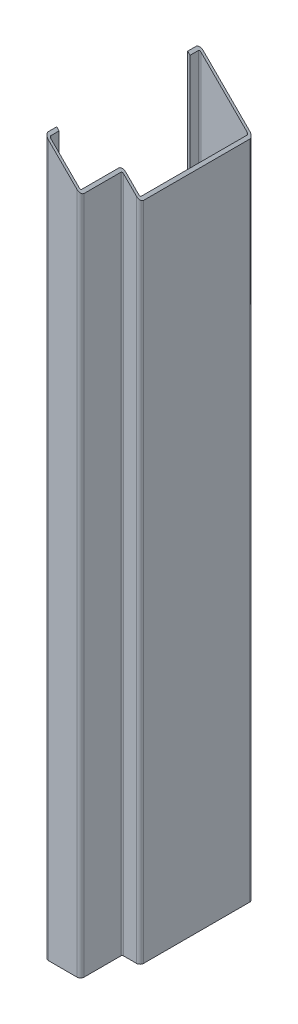
ISO-10303-21;
HEADER;
FILE_DESCRIPTION(('STEP AP214'),'2;1');
FILE_NAME('part.step','',(''),(''),'','','');
FILE_SCHEMA(('AUTOMOTIVE_DESIGN { 1 0 10303 214 1 1 1 1 }'));
ENDSEC;
DATA;
#1=APPLICATION_CONTEXT('core data for automotive mechanical design processes');
#2=APPLICATION_PROTOCOL_DEFINITION('international standard','automotive_design',2000,#1);
#3=PRODUCT_CONTEXT('',#1,'mechanical');
#4=PRODUCT('Part','Part','',(#3));
#5=PRODUCT_RELATED_PRODUCT_CATEGORY('part','',(#4));
#6=PRODUCT_DEFINITION_FORMATION('','',#4);
#7=PRODUCT_DEFINITION_CONTEXT('part definition',#1,'design');
#8=PRODUCT_DEFINITION('design','',#6,#7);
#9=PRODUCT_DEFINITION_SHAPE('','',#8);
#10=(LENGTH_UNIT() NAMED_UNIT(*) SI_UNIT(.MILLI.,.METRE.));
#11=(NAMED_UNIT(*) PLANE_ANGLE_UNIT() SI_UNIT($,.RADIAN.));
#12=(NAMED_UNIT(*) SI_UNIT($,.STERADIAN.) SOLID_ANGLE_UNIT());
#13=UNCERTAINTY_MEASURE_WITH_UNIT(LENGTH_MEASURE(1.E-05),#10,'distance_accuracy_value','');
#14=(GEOMETRIC_REPRESENTATION_CONTEXT(3) GLOBAL_UNCERTAINTY_ASSIGNED_CONTEXT((#13)) GLOBAL_UNIT_ASSIGNED_CONTEXT((#10,
#11,#12)) REPRESENTATION_CONTEXT('',''));
#15=CARTESIAN_POINT('',(0.,0.,0.));
#16=DIRECTION('',(0.,0.,1.));
#17=DIRECTION('',(1.,0.,0.));
#18=AXIS2_PLACEMENT_3D('',#15,#16,#17);
#19=CARTESIAN_POINT('',(-22.5,600.,-62.));
#20=DIRECTION('',(1.,0.,0.));
#21=DIRECTION('',(0.,0.,-1.));
#22=AXIS2_PLACEMENT_3D('',#19,#20,#21);
#23=PLANE('',#22);
#24=DIRECTION('',(0.,0.,1.));
#25=VECTOR('',#24,1.);
#26=CARTESIAN_POINT('',(-22.5,0.,-62.));
#27=LINE('',#26,#25);
#28=CARTESIAN_POINT('',(-22.5,0.,-62.));
#29=VERTEX_POINT('',#28);
#30=CARTESIAN_POINT('',(-22.5,0.,-55.));
#31=VERTEX_POINT('',#30);
#32=EDGE_CURVE('E166',#29,#31,#27,.T.);
#33=ORIENTED_EDGE('',*,*,#32,.T.);
#34=DIRECTION('',(0.,-1.,0.));
#35=VECTOR('',#34,1.);
#36=CARTESIAN_POINT('',(-22.5,600.,-55.));
#37=LINE('',#36,#35);
#38=CARTESIAN_POINT('',(-22.5,600.,-55.));
#39=VERTEX_POINT('',#38);
#40=EDGE_CURVE('E11',#39,#31,#37,.T.);
#41=ORIENTED_EDGE('',*,*,#40,.F.);
#42=DIRECTION('',(0.,0.,1.));
#43=VECTOR('',#42,1.);
#44=CARTESIAN_POINT('',(-22.5,600.,-62.));
#45=LINE('',#44,#43);
#46=CARTESIAN_POINT('',(-22.5,600.,-62.));
#47=VERTEX_POINT('',#46);
#48=EDGE_CURVE('E167',#47,#39,#45,.T.);
#49=ORIENTED_EDGE('',*,*,#48,.F.);
#50=DIRECTION('',(0.,-1.,0.));
#51=VECTOR('',#50,1.);
#52=CARTESIAN_POINT('',(-22.5,600.,-62.));
#53=LINE('',#52,#51);
#54=EDGE_CURVE('E151',#47,#29,#53,.T.);
#55=ORIENTED_EDGE('',*,*,#54,.T.);
#56=EDGE_LOOP('',(#33,#41,#49,#55));
#57=FACE_BOUND('',#56,.T.);
#58=ADVANCED_FACE('F35',(#57),#23,.F.);
#59=CARTESIAN_POINT('',(-20.5,600.,-55.));
#60=DIRECTION('',(0.,0.,1.));
#61=DIRECTION('',(1.,0.,0.));
#62=AXIS2_PLACEMENT_3D('',#59,#60,#61);
#63=PLANE('',#62);
#64=DIRECTION('',(0.707106781186547,-0.707106781186548,0.));
#65=VECTOR('',#64,1.);
#66=CARTESIAN_POINT('',(-21.5,599.,-55.));
#67=LINE('',#66,#65);
#68=CARTESIAN_POINT('',(-20.5,598.,-55.));
#69=VERTEX_POINT('',#68);
#70=EDGE_CURVE('E426',#39,#69,#67,.T.);
#71=ORIENTED_EDGE('',*,*,#70,.F.);
#72=ORIENTED_EDGE('',*,*,#40,.T.);
#73=DIRECTION('',(-1.,0.,0.));
#74=VECTOR('',#73,1.);
#75=CARTESIAN_POINT('',(-20.5,0.,-55.));
#76=LINE('',#75,#74);
#77=CARTESIAN_POINT('',(-20.5,0.,-55.));
#78=VERTEX_POINT('',#77);
#79=EDGE_CURVE('E236',#78,#31,#76,.T.);
#80=ORIENTED_EDGE('',*,*,#79,.F.);
#81=DIRECTION('',(0.,-1.,0.));
#82=VECTOR('',#81,1.);
#83=CARTESIAN_POINT('',(-20.5,600.,-55.));
#84=LINE('',#83,#82);
#85=EDGE_CURVE('E43',#69,#78,#84,.T.);
#86=ORIENTED_EDGE('',*,*,#85,.F.);
#87=EDGE_LOOP('',(#71,#72,#80,#86));
#88=FACE_BOUND('',#87,.T.);
#89=ADVANCED_FACE('F237',(#88),#63,.T.);
#90=CARTESIAN_POINT('',(-20.5,600.,-62.));
#91=DIRECTION('',(1.,0.,0.));
#92=DIRECTION('',(0.,0.,-1.));
#93=AXIS2_PLACEMENT_3D('',#90,#91,#92);
#94=PLANE('',#93);
#95=DIRECTION('',(0.,0.,-1.));
#96=VECTOR('',#95,1.);
#97=CARTESIAN_POINT('',(-20.5,598.,-62.));
#98=LINE('',#97,#96);
#99=CARTESIAN_POINT('',(-20.5,598.,-62.));
#100=VERTEX_POINT('',#99);
#101=EDGE_CURVE('E233',#69,#100,#98,.T.);
#102=ORIENTED_EDGE('',*,*,#101,.F.);
#103=ORIENTED_EDGE('',*,*,#85,.T.);
#104=DIRECTION('',(0.,0.,-1.));
#105=VECTOR('',#104,1.);
#106=CARTESIAN_POINT('',(-20.5,0.,-62.));
#107=LINE('',#106,#105);
#108=CARTESIAN_POINT('',(-20.5,0.,-62.));
#109=VERTEX_POINT('',#108);
#110=EDGE_CURVE('E230',#109,#78,#107,.F.);
#111=ORIENTED_EDGE('',*,*,#110,.F.);
#112=DIRECTION('',(0.,-1.,0.));
#113=VECTOR('',#112,1.);
#114=CARTESIAN_POINT('',(-20.5,600.,-62.));
#115=LINE('',#114,#113);
#116=EDGE_CURVE('E221',#100,#109,#115,.T.);
#117=ORIENTED_EDGE('',*,*,#116,.F.);
#118=EDGE_LOOP('',(#102,#103,#111,#117));
#119=FACE_BOUND('',#118,.T.);
#120=ADVANCED_FACE('F227',(#119),#94,.T.);
#121=CARTESIAN_POINT('',(-19.5,600.,-62.));
#122=DIRECTION('',(0.,-1.,0.));
#123=DIRECTION('',(0.,0.,-1.));
#124=AXIS2_PLACEMENT_3D('',#121,#122,#123);
#125=CYLINDRICAL_SURFACE('',#124,1.);
#126=CARTESIAN_POINT('',(-19.5,597.,-62.));
#127=DIRECTION('',(-0.707106781186548,-0.707106781186547,0.));
#128=DIRECTION('',(0.707106781186547,-0.707106781186548,0.));
#129=AXIS2_PLACEMENT_3D('',#126,#127,#128);
#130=ELLIPSE('',#129,1.4142135623731,1.);
#131=CARTESIAN_POINT('',(-19.5,597.,-63.));
#132=VERTEX_POINT('',#131);
#133=EDGE_CURVE('E430',#100,#132,#130,.T.);
#134=ORIENTED_EDGE('',*,*,#133,.F.);
#135=ORIENTED_EDGE('',*,*,#116,.T.);
#136=CARTESIAN_POINT('',(-19.5,0.,-62.));
#137=DIRECTION('',(0.,1.,0.));
#138=DIRECTION('',(1.,0.,0.));
#139=AXIS2_PLACEMENT_3D('',#136,#137,#138);
#140=CIRCLE('',#139,1.);
#141=CARTESIAN_POINT('',(-19.5,0.,-63.));
#142=VERTEX_POINT('',#141);
#143=EDGE_CURVE('E242',#142,#109,#140,.T.);
#144=ORIENTED_EDGE('',*,*,#143,.F.);
#145=DIRECTION('',(0.,-1.,0.));
#146=VECTOR('',#145,1.);
#147=CARTESIAN_POINT('',(-19.5,600.,-63.));
#148=LINE('',#147,#146);
#149=EDGE_CURVE('E219',#132,#142,#148,.T.);
#150=ORIENTED_EDGE('',*,*,#149,.F.);
#151=EDGE_LOOP('',(#134,#135,#144,#150));
#152=FACE_BOUND('',#151,.T.);
#153=ADVANCED_FACE('F487',(#152),#125,.F.);
#154=CARTESIAN_POINT('',(19.5,600.,-63.));
#155=DIRECTION('',(0.,0.,1.));
#156=DIRECTION('',(1.,0.,0.));
#157=AXIS2_PLACEMENT_3D('',#154,#155,#156);
#158=PLANE('',#157);
#159=DIRECTION('',(0.707106781186547,-0.707106781186548,0.));
#160=VECTOR('',#159,1.);
#161=CARTESIAN_POINT('',(-1.5,579.,-63.));
#162=LINE('',#161,#160);
#163=CARTESIAN_POINT('',(19.5,558.,-63.));
#164=VERTEX_POINT('',#163);
#165=EDGE_CURVE('E435',#132,#164,#162,.T.);
#166=ORIENTED_EDGE('',*,*,#165,.F.);
#167=ORIENTED_EDGE('',*,*,#149,.T.);
#168=DIRECTION('',(1.,0.,0.));
#169=VECTOR('',#168,1.);
#170=CARTESIAN_POINT('',(19.5,0.,-63.));
#171=LINE('',#170,#169);
#172=CARTESIAN_POINT('',(19.5,0.,-63.));
#173=VERTEX_POINT('',#172);
#174=EDGE_CURVE('E244',#173,#142,#171,.F.);
#175=ORIENTED_EDGE('',*,*,#174,.F.);
#176=DIRECTION('',(0.,-1.,0.));
#177=VECTOR('',#176,1.);
#178=CARTESIAN_POINT('',(19.5,600.,-63.));
#179=LINE('',#178,#177);
#180=EDGE_CURVE('E217',#164,#173,#179,.T.);
#181=ORIENTED_EDGE('',*,*,#180,.F.);
#182=EDGE_LOOP('',(#166,#167,#175,#181));
#183=FACE_BOUND('',#182,.T.);
#184=ADVANCED_FACE('F492',(#183),#158,.T.);
#185=CARTESIAN_POINT('',(19.5,600.,-62.));
#186=DIRECTION('',(0.,-1.,0.));
#187=DIRECTION('',(0.,0.,-1.));
#188=AXIS2_PLACEMENT_3D('',#185,#186,#187);
#189=CYLINDRICAL_SURFACE('',#188,1.);
#190=CARTESIAN_POINT('',(19.5,558.,-62.));
#191=DIRECTION('',(-0.707106781186548,-0.707106781186547,0.));
#192=DIRECTION('',(0.707106781186547,-0.707106781186548,0.));
#193=AXIS2_PLACEMENT_3D('',#190,#191,#192);
#194=ELLIPSE('',#193,1.4142135623731,1.);
#195=CARTESIAN_POINT('',(20.5,557.,-62.));
#196=VERTEX_POINT('',#195);
#197=EDGE_CURVE('E437',#164,#196,#194,.T.);
#198=ORIENTED_EDGE('',*,*,#197,.F.);
#199=ORIENTED_EDGE('',*,*,#180,.T.);
#200=CARTESIAN_POINT('',(19.5,0.,-62.));
#201=DIRECTION('',(0.,1.,0.));
#202=DIRECTION('',(1.,0.,0.));
#203=AXIS2_PLACEMENT_3D('',#200,#201,#202);
#204=CIRCLE('',#203,1.);
#205=CARTESIAN_POINT('',(20.5,0.,-62.));
#206=VERTEX_POINT('',#205);
#207=EDGE_CURVE('E249',#206,#173,#204,.T.);
#208=ORIENTED_EDGE('',*,*,#207,.F.);
#209=DIRECTION('',(0.,-1.,0.));
#210=VECTOR('',#209,1.);
#211=CARTESIAN_POINT('',(20.5,600.,-62.));
#212=LINE('',#211,#210);
#213=EDGE_CURVE('E215',#196,#206,#212,.T.);
#214=ORIENTED_EDGE('',*,*,#213,.F.);
#215=EDGE_LOOP('',(#198,#199,#208,#214));
#216=FACE_BOUND('',#215,.T.);
#217=ADVANCED_FACE('F496',(#216),#189,.F.);
#218=CARTESIAN_POINT('',(20.5,600.,27.));
#219=DIRECTION('',(-1.,0.,0.));
#220=DIRECTION('',(0.,0.,1.));
#221=AXIS2_PLACEMENT_3D('',#218,#219,#220);
#222=PLANE('',#221);
#223=DIRECTION('',(0.,0.,1.));
#224=VECTOR('',#223,1.);
#225=CARTESIAN_POINT('',(20.5,557.,27.));
#226=LINE('',#225,#224);
#227=CARTESIAN_POINT('',(20.5,557.,27.));
#228=VERTEX_POINT('',#227);
#229=EDGE_CURVE('E439',#196,#228,#226,.T.);
#230=ORIENTED_EDGE('',*,*,#229,.F.);
#231=ORIENTED_EDGE('',*,*,#213,.T.);
#232=DIRECTION('',(0.,0.,-1.));
#233=VECTOR('',#232,1.);
#234=CARTESIAN_POINT('',(20.5,0.,27.));
#235=LINE('',#234,#233);
#236=CARTESIAN_POINT('',(20.5,0.,27.));
#237=VERTEX_POINT('',#236);
#238=EDGE_CURVE('E252',#237,#206,#235,.T.);
#239=ORIENTED_EDGE('',*,*,#238,.F.);
#240=DIRECTION('',(0.,-1.,0.));
#241=VECTOR('',#240,1.);
#242=CARTESIAN_POINT('',(20.5,600.,27.));
#243=LINE('',#242,#241);
#244=EDGE_CURVE('E213',#228,#237,#243,.T.);
#245=ORIENTED_EDGE('',*,*,#244,.F.);
#246=EDGE_LOOP('',(#230,#231,#239,#245));
#247=FACE_BOUND('',#246,.T.);
#248=ADVANCED_FACE('F500',(#247),#222,.T.);
#249=CARTESIAN_POINT('',(19.5,600.,27.));
#250=DIRECTION('',(0.,-1.,0.));
#251=DIRECTION('',(0.,0.,-1.));
#252=AXIS2_PLACEMENT_3D('',#249,#250,#251);
#253=CYLINDRICAL_SURFACE('',#252,0.999999999999999);
#254=CARTESIAN_POINT('',(19.5,558.,27.));
#255=DIRECTION('',(-0.707106781186548,-0.707106781186547,0.));
#256=DIRECTION('',(0.707106781186547,-0.707106781186548,0.));
#257=AXIS2_PLACEMENT_3D('',#254,#255,#256);
#258=ELLIPSE('',#257,1.41421356237309,0.999999999999999);
#259=CARTESIAN_POINT('',(19.5,558.,28.));
#260=VERTEX_POINT('',#259);
#261=EDGE_CURVE('E441',#228,#260,#258,.T.);
#262=ORIENTED_EDGE('',*,*,#261,.F.);
#263=ORIENTED_EDGE('',*,*,#244,.T.);
#264=CARTESIAN_POINT('',(19.5,0.,27.));
#265=DIRECTION('',(0.,1.,0.));
#266=DIRECTION('',(1.,0.,0.));
#267=AXIS2_PLACEMENT_3D('',#264,#265,#266);
#268=CIRCLE('',#267,0.999999999999999);
#269=CARTESIAN_POINT('',(19.5,0.,28.));
#270=VERTEX_POINT('',#269);
#271=EDGE_CURVE('E255',#270,#237,#268,.T.);
#272=ORIENTED_EDGE('',*,*,#271,.F.);
#273=DIRECTION('',(0.,-1.,0.));
#274=VECTOR('',#273,1.);
#275=CARTESIAN_POINT('',(19.5,600.,28.));
#276=LINE('',#275,#274);
#277=EDGE_CURVE('E211',#260,#270,#276,.T.);
#278=ORIENTED_EDGE('',*,*,#277,.F.);
#279=EDGE_LOOP('',(#262,#263,#272,#278));
#280=FACE_BOUND('',#279,.T.);
#281=ADVANCED_FACE('F504',(#280),#253,.F.);
#282=CARTESIAN_POINT('',(8.50000000000001,600.,28.));
#283=DIRECTION('',(0.,0.,-1.));
#284=DIRECTION('',(-1.,0.,0.));
#285=AXIS2_PLACEMENT_3D('',#282,#283,#284);
#286=PLANE('',#285);
#287=DIRECTION('',(-0.707106781186547,0.707106781186548,0.));
#288=VECTOR('',#287,1.);
#289=CARTESIAN_POINT('',(-7.,584.5,28.));
#290=LINE('',#289,#288);
#291=CARTESIAN_POINT('',(8.50000000000001,569.,28.));
#292=VERTEX_POINT('',#291);
#293=EDGE_CURVE('E443',#260,#292,#290,.T.);
#294=ORIENTED_EDGE('',*,*,#293,.F.);
#295=ORIENTED_EDGE('',*,*,#277,.T.);
#296=DIRECTION('',(1.,0.,0.));
#297=VECTOR('',#296,1.);
#298=CARTESIAN_POINT('',(8.50000000000001,0.,28.));
#299=LINE('',#298,#297);
#300=CARTESIAN_POINT('',(8.50000000000001,0.,28.));
#301=VERTEX_POINT('',#300);
#302=EDGE_CURVE('E258',#301,#270,#299,.T.);
#303=ORIENTED_EDGE('',*,*,#302,.F.);
#304=DIRECTION('',(0.,-1.,0.));
#305=VECTOR('',#304,1.);
#306=CARTESIAN_POINT('',(8.50000000000001,600.,28.));
#307=LINE('',#306,#305);
#308=EDGE_CURVE('E209',#292,#301,#307,.T.);
#309=ORIENTED_EDGE('',*,*,#308,.F.);
#310=EDGE_LOOP('',(#294,#295,#303,#309));
#311=FACE_BOUND('',#310,.T.);
#312=ADVANCED_FACE('F508',(#311),#286,.T.);
#313=CARTESIAN_POINT('',(8.50000000000001,600.,31.));
#314=DIRECTION('',(0.,-1.,0.));
#315=DIRECTION('',(0.,0.,-1.));
#316=AXIS2_PLACEMENT_3D('',#313,#314,#315);
#317=CYLINDRICAL_SURFACE('',#316,3.);
#318=CARTESIAN_POINT('',(8.50000000000001,569.,31.));
#319=DIRECTION('',(-0.707106781186548,-0.707106781186547,0.));
#320=DIRECTION('',(0.707106781186547,-0.707106781186548,0.));
#321=AXIS2_PLACEMENT_3D('',#318,#319,#320);
#322=ELLIPSE('',#321,4.24264068711929,3.);
#323=CARTESIAN_POINT('',(5.50000000000001,572.,31.));
#324=VERTEX_POINT('',#323);
#325=EDGE_CURVE('E445',#292,#324,#322,.F.);
#326=ORIENTED_EDGE('',*,*,#325,.F.);
#327=ORIENTED_EDGE('',*,*,#308,.T.);
#328=CARTESIAN_POINT('',(8.50000000000001,0.,31.));
#329=DIRECTION('',(0.,1.,0.));
#330=DIRECTION('',(1.,0.,0.));
#331=AXIS2_PLACEMENT_3D('',#328,#329,#330);
#332=CIRCLE('',#331,3.);
#333=CARTESIAN_POINT('',(5.50000000000001,0.,31.));
#334=VERTEX_POINT('',#333);
#335=EDGE_CURVE('E261',#334,#301,#332,.F.);
#336=ORIENTED_EDGE('',*,*,#335,.F.);
#337=DIRECTION('',(0.,-1.,0.));
#338=VECTOR('',#337,1.);
#339=CARTESIAN_POINT('',(5.50000000000001,600.,31.));
#340=LINE('',#339,#338);
#341=EDGE_CURVE('E207',#324,#334,#340,.T.);
#342=ORIENTED_EDGE('',*,*,#341,.F.);
#343=EDGE_LOOP('',(#326,#327,#336,#342));
#344=FACE_BOUND('',#343,.T.);
#345=ADVANCED_FACE('F512',(#344),#317,.T.);
#346=CARTESIAN_POINT('',(5.50000000000001,600.,62.));
#347=DIRECTION('',(-1.,0.,0.));
#348=DIRECTION('',(0.,0.,1.));
#349=AXIS2_PLACEMENT_3D('',#346,#347,#348);
#350=PLANE('',#349);
#351=DIRECTION('',(0.,0.,1.));
#352=VECTOR('',#351,1.);
#353=CARTESIAN_POINT('',(5.50000000000001,572.,62.));
#354=LINE('',#353,#352);
#355=CARTESIAN_POINT('',(5.50000000000001,572.,62.));
#356=VERTEX_POINT('',#355);
#357=EDGE_CURVE('E447',#324,#356,#354,.T.);
#358=ORIENTED_EDGE('',*,*,#357,.F.);
#359=ORIENTED_EDGE('',*,*,#341,.T.);
#360=DIRECTION('',(0.,0.,-1.));
#361=VECTOR('',#360,1.);
#362=CARTESIAN_POINT('',(5.50000000000001,0.,62.));
#363=LINE('',#362,#361);
#364=CARTESIAN_POINT('',(5.50000000000001,0.,62.));
#365=VERTEX_POINT('',#364);
#366=EDGE_CURVE('E264',#365,#334,#363,.T.);
#367=ORIENTED_EDGE('',*,*,#366,.F.);
#368=DIRECTION('',(0.,-1.,0.));
#369=VECTOR('',#368,1.);
#370=CARTESIAN_POINT('',(5.50000000000001,600.,62.));
#371=LINE('',#370,#369);
#372=EDGE_CURVE('E205',#356,#365,#371,.T.);
#373=ORIENTED_EDGE('',*,*,#372,.F.);
#374=EDGE_LOOP('',(#358,#359,#367,#373));
#375=FACE_BOUND('',#374,.T.);
#376=ADVANCED_FACE('F516',(#375),#350,.T.);
#377=CARTESIAN_POINT('',(4.50000000000001,600.,62.));
#378=DIRECTION('',(0.,-1.,0.));
#379=DIRECTION('',(0.,0.,-1.));
#380=AXIS2_PLACEMENT_3D('',#377,#378,#379);
#381=CYLINDRICAL_SURFACE('',#380,1.);
#382=CARTESIAN_POINT('',(4.50000000000001,573.,62.));
#383=DIRECTION('',(-0.707106781186548,-0.707106781186547,0.));
#384=DIRECTION('',(0.707106781186547,-0.707106781186548,0.));
#385=AXIS2_PLACEMENT_3D('',#382,#383,#384);
#386=ELLIPSE('',#385,1.4142135623731,1.);
#387=CARTESIAN_POINT('',(4.50000000000001,573.,63.));
#388=VERTEX_POINT('',#387);
#389=EDGE_CURVE('E449',#356,#388,#386,.T.);
#390=ORIENTED_EDGE('',*,*,#389,.F.);
#391=ORIENTED_EDGE('',*,*,#372,.T.);
#392=CARTESIAN_POINT('',(4.50000000000001,0.,62.));
#393=DIRECTION('',(0.,1.,0.));
#394=DIRECTION('',(1.,0.,0.));
#395=AXIS2_PLACEMENT_3D('',#392,#393,#394);
#396=CIRCLE('',#395,1.);
#397=CARTESIAN_POINT('',(4.50000000000001,0.,63.));
#398=VERTEX_POINT('',#397);
#399=EDGE_CURVE('E267',#398,#365,#396,.T.);
#400=ORIENTED_EDGE('',*,*,#399,.F.);
#401=DIRECTION('',(0.,-1.,0.));
#402=VECTOR('',#401,1.);
#403=CARTESIAN_POINT('',(4.50000000000001,600.,63.));
#404=LINE('',#403,#402);
#405=EDGE_CURVE('E203',#388,#398,#404,.T.);
#406=ORIENTED_EDGE('',*,*,#405,.F.);
#407=EDGE_LOOP('',(#390,#391,#400,#406));
#408=FACE_BOUND('',#407,.T.);
#409=ADVANCED_FACE('F520',(#408),#381,.F.);
#410=CARTESIAN_POINT('',(-19.5,600.,63.));
#411=DIRECTION('',(0.,0.,-1.));
#412=DIRECTION('',(-1.,0.,0.));
#413=AXIS2_PLACEMENT_3D('',#410,#411,#412);
#414=PLANE('',#413);
#415=DIRECTION('',(-0.707106781186547,0.707106781186548,0.));
#416=VECTOR('',#415,1.);
#417=CARTESIAN_POINT('',(-21.,598.5,63.));
#418=LINE('',#417,#416);
#419=CARTESIAN_POINT('',(-19.5,597.,63.));
#420=VERTEX_POINT('',#419);
#421=EDGE_CURVE('E451',#388,#420,#418,.T.);
#422=ORIENTED_EDGE('',*,*,#421,.F.);
#423=ORIENTED_EDGE('',*,*,#405,.T.);
#424=DIRECTION('',(1.,0.,0.));
#425=VECTOR('',#424,1.);
#426=CARTESIAN_POINT('',(-19.5,0.,63.));
#427=LINE('',#426,#425);
#428=CARTESIAN_POINT('',(-19.5,0.,63.));
#429=VERTEX_POINT('',#428);
#430=EDGE_CURVE('E270',#429,#398,#427,.T.);
#431=ORIENTED_EDGE('',*,*,#430,.F.);
#432=DIRECTION('',(0.,-1.,0.));
#433=VECTOR('',#432,1.);
#434=CARTESIAN_POINT('',(-19.5,600.,63.));
#435=LINE('',#434,#433);
#436=EDGE_CURVE('E201',#420,#429,#435,.T.);
#437=ORIENTED_EDGE('',*,*,#436,.F.);
#438=EDGE_LOOP('',(#422,#423,#431,#437));
#439=FACE_BOUND('',#438,.T.);
#440=ADVANCED_FACE('F524',(#439),#414,.T.);
#441=CARTESIAN_POINT('',(-19.5,600.,62.));
#442=DIRECTION('',(0.,-1.,0.));
#443=DIRECTION('',(0.,0.,-1.));
#444=AXIS2_PLACEMENT_3D('',#441,#442,#443);
#445=CYLINDRICAL_SURFACE('',#444,1.);
#446=CARTESIAN_POINT('',(-19.5,597.,62.));
#447=DIRECTION('',(-0.707106781186548,-0.707106781186547,0.));
#448=DIRECTION('',(0.707106781186547,-0.707106781186548,0.));
#449=AXIS2_PLACEMENT_3D('',#446,#447,#448);
#450=ELLIPSE('',#449,1.4142135623731,1.);
#451=CARTESIAN_POINT('',(-20.5,598.,62.));
#452=VERTEX_POINT('',#451);
#453=EDGE_CURVE('E453',#420,#452,#450,.T.);
#454=ORIENTED_EDGE('',*,*,#453,.F.);
#455=ORIENTED_EDGE('',*,*,#436,.T.);
#456=CARTESIAN_POINT('',(-19.5,0.,62.));
#457=DIRECTION('',(0.,1.,0.));
#458=DIRECTION('',(1.,0.,0.));
#459=AXIS2_PLACEMENT_3D('',#456,#457,#458);
#460=CIRCLE('',#459,1.);
#461=CARTESIAN_POINT('',(-20.5,0.,62.));
#462=VERTEX_POINT('',#461);
#463=EDGE_CURVE('E273',#462,#429,#460,.T.);
#464=ORIENTED_EDGE('',*,*,#463,.F.);
#465=DIRECTION('',(0.,-1.,0.));
#466=VECTOR('',#465,1.);
#467=CARTESIAN_POINT('',(-20.5,600.,62.));
#468=LINE('',#467,#466);
#469=EDGE_CURVE('E199',#452,#462,#468,.T.);
#470=ORIENTED_EDGE('',*,*,#469,.F.);
#471=EDGE_LOOP('',(#454,#455,#464,#470));
#472=FACE_BOUND('',#471,.T.);
#473=ADVANCED_FACE('F528',(#472),#445,.F.);
#474=CARTESIAN_POINT('',(-20.5,600.,55.));
#475=DIRECTION('',(1.,0.,0.));
#476=DIRECTION('',(0.,0.,-1.));
#477=AXIS2_PLACEMENT_3D('',#474,#475,#476);
#478=PLANE('',#477);
#479=DIRECTION('',(0.,0.,-1.));
#480=VECTOR('',#479,1.);
#481=CARTESIAN_POINT('',(-20.5,598.,55.));
#482=LINE('',#481,#480);
#483=CARTESIAN_POINT('',(-20.5,598.,55.));
#484=VERTEX_POINT('',#483);
#485=EDGE_CURVE('E455',#452,#484,#482,.T.);
#486=ORIENTED_EDGE('',*,*,#485,.F.);
#487=ORIENTED_EDGE('',*,*,#469,.T.);
#488=DIRECTION('',(0.,0.,1.));
#489=VECTOR('',#488,1.);
#490=CARTESIAN_POINT('',(-20.5,0.,55.));
#491=LINE('',#490,#489);
#492=CARTESIAN_POINT('',(-20.5,0.,55.));
#493=VERTEX_POINT('',#492);
#494=EDGE_CURVE('E276',#493,#462,#491,.T.);
#495=ORIENTED_EDGE('',*,*,#494,.F.);
#496=DIRECTION('',(0.,-1.,0.));
#497=VECTOR('',#496,1.);
#498=CARTESIAN_POINT('',(-20.5,600.,55.));
#499=LINE('',#498,#497);
#500=EDGE_CURVE('E197',#484,#493,#499,.T.);
#501=ORIENTED_EDGE('',*,*,#500,.F.);
#502=EDGE_LOOP('',(#486,#487,#495,#501));
#503=FACE_BOUND('',#502,.T.);
#504=ADVANCED_FACE('F532',(#503),#478,.T.);
#505=CARTESIAN_POINT('',(-22.5,600.,55.));
#506=DIRECTION('',(0.,0.,-1.));
#507=DIRECTION('',(-1.,0.,0.));
#508=AXIS2_PLACEMENT_3D('',#505,#506,#507);
#509=PLANE('',#508);
#510=DIRECTION('',(-0.707106781186547,0.707106781186548,0.));
#511=VECTOR('',#510,1.);
#512=CARTESIAN_POINT('',(-22.5,600.,55.));
#513=LINE('',#512,#511);
#514=CARTESIAN_POINT('',(-22.5,600.,55.));
#515=VERTEX_POINT('',#514);
#516=EDGE_CURVE('E50',#484,#515,#513,.T.);
#517=ORIENTED_EDGE('',*,*,#516,.F.);
#518=ORIENTED_EDGE('',*,*,#500,.T.);
#519=DIRECTION('',(1.,0.,0.));
#520=VECTOR('',#519,1.);
#521=CARTESIAN_POINT('',(-22.5,0.,55.));
#522=LINE('',#521,#520);
#523=CARTESIAN_POINT('',(-22.5,0.,55.));
#524=VERTEX_POINT('',#523);
#525=EDGE_CURVE('E279',#524,#493,#522,.T.);
#526=ORIENTED_EDGE('',*,*,#525,.F.);
#527=DIRECTION('',(0.,-1.,0.));
#528=VECTOR('',#527,1.);
#529=CARTESIAN_POINT('',(-22.5,600.,55.));
#530=LINE('',#529,#528);
#531=EDGE_CURVE('E195',#515,#524,#530,.T.);
#532=ORIENTED_EDGE('',*,*,#531,.F.);
#533=EDGE_LOOP('',(#517,#518,#526,#532));
#534=FACE_BOUND('',#533,.T.);
#535=ADVANCED_FACE('F536',(#534),#509,.T.);
#536=CARTESIAN_POINT('',(-22.5,600.,55.));
#537=DIRECTION('',(1.,0.,0.));
#538=DIRECTION('',(0.,0.,-1.));
#539=AXIS2_PLACEMENT_3D('',#536,#537,#538);
#540=PLANE('',#539);
#541=DIRECTION('',(0.,0.,1.));
#542=VECTOR('',#541,1.);
#543=CARTESIAN_POINT('',(-22.5,0.,55.));
#544=LINE('',#543,#542);
#545=CARTESIAN_POINT('',(-22.5,0.,62.));
#546=VERTEX_POINT('',#545);
#547=EDGE_CURVE('E282',#524,#546,#544,.T.);
#548=ORIENTED_EDGE('',*,*,#547,.T.);
#549=DIRECTION('',(0.,-1.,0.));
#550=VECTOR('',#549,1.);
#551=CARTESIAN_POINT('',(-22.5,600.,62.));
#552=LINE('',#551,#550);
#553=CARTESIAN_POINT('',(-22.5,600.,62.));
#554=VERTEX_POINT('',#553);
#555=EDGE_CURVE('E192',#554,#546,#552,.T.);
#556=ORIENTED_EDGE('',*,*,#555,.F.);
#557=DIRECTION('',(0.,0.,1.));
#558=VECTOR('',#557,1.);
#559=CARTESIAN_POINT('',(-22.5,600.,55.));
#560=LINE('',#559,#558);
#561=EDGE_CURVE('E170',#515,#554,#560,.T.);
#562=ORIENTED_EDGE('',*,*,#561,.F.);
#563=ORIENTED_EDGE('',*,*,#531,.T.);
#564=EDGE_LOOP('',(#548,#556,#562,#563));
#565=FACE_BOUND('',#564,.T.);
#566=ADVANCED_FACE('F376',(#565),#540,.F.);
#567=CARTESIAN_POINT('',(-19.5,600.,62.));
#568=DIRECTION('',(0.,-1.,0.));
#569=DIRECTION('',(0.,0.,-1.));
#570=AXIS2_PLACEMENT_3D('',#567,#568,#569);
#571=CYLINDRICAL_SURFACE('',#570,3.);
#572=DIRECTION('',(0.,-1.,0.));
#573=VECTOR('',#572,1.);
#574=CARTESIAN_POINT('',(-19.5,600.,65.));
#575=LINE('',#574,#573);
#576=CARTESIAN_POINT('',(-19.5,597.,65.));
#577=VERTEX_POINT('',#576);
#578=CARTESIAN_POINT('',(-19.5,0.,65.));
#579=VERTEX_POINT('',#578);
#580=EDGE_CURVE('E190',#577,#579,#575,.T.);
#581=ORIENTED_EDGE('',*,*,#580,.F.);
#582=CARTESIAN_POINT('',(-19.5,597.,62.));
#583=DIRECTION('',(-0.707106781186548,-0.707106781186547,0.));
#584=DIRECTION('',(0.707106781186547,-0.707106781186548,0.));
#585=AXIS2_PLACEMENT_3D('',#582,#583,#584);
#586=ELLIPSE('',#585,4.24264068711929,3.);
#587=EDGE_CURVE('E373',#577,#554,#586,.T.);
#588=ORIENTED_EDGE('',*,*,#587,.T.);
#589=ORIENTED_EDGE('',*,*,#555,.T.);
#590=CARTESIAN_POINT('',(-19.5,0.,62.));
#591=DIRECTION('',(0.,1.,0.));
#592=DIRECTION('',(0.,0.,1.));
#593=AXIS2_PLACEMENT_3D('',#590,#591,#592);
#594=CIRCLE('',#593,3.);
#595=EDGE_CURVE('E284',#546,#579,#594,.T.);
#596=ORIENTED_EDGE('',*,*,#595,.T.);
#597=EDGE_LOOP('',(#581,#588,#589,#596));
#598=FACE_BOUND('',#597,.T.);
#599=ADVANCED_FACE('F369',(#598),#571,.T.);
#600=CARTESIAN_POINT('',(-19.5,600.,65.));
#601=DIRECTION('',(0.,0.,-1.));
#602=DIRECTION('',(-1.,0.,0.));
#603=AXIS2_PLACEMENT_3D('',#600,#601,#602);
#604=PLANE('',#603);
#605=DIRECTION('',(0.,-1.,0.));
#606=VECTOR('',#605,1.);
#607=CARTESIAN_POINT('',(4.50000000000001,600.,65.));
#608=LINE('',#607,#606);
#609=CARTESIAN_POINT('',(4.50000000000001,573.,65.));
#610=VERTEX_POINT('',#609);
#611=CARTESIAN_POINT('',(4.50000000000001,0.,65.));
#612=VERTEX_POINT('',#611);
#613=EDGE_CURVE('E188',#610,#612,#608,.T.);
#614=ORIENTED_EDGE('',*,*,#613,.F.);
#615=DIRECTION('',(0.707106781186547,-0.707106781186548,0.));
#616=VECTOR('',#615,1.);
#617=CARTESIAN_POINT('',(-22.5,600.,65.));
#618=LINE('',#617,#616);
#619=EDGE_CURVE('E366',#577,#610,#618,.T.);
#620=ORIENTED_EDGE('',*,*,#619,.F.);
#621=ORIENTED_EDGE('',*,*,#580,.T.);
#622=DIRECTION('',(1.,0.,0.));
#623=VECTOR('',#622,1.);
#624=CARTESIAN_POINT('',(-19.5,0.,65.));
#625=LINE('',#624,#623);
#626=EDGE_CURVE('E287',#579,#612,#625,.T.);
#627=ORIENTED_EDGE('',*,*,#626,.T.);
#628=EDGE_LOOP('',(#614,#620,#621,#627));
#629=FACE_BOUND('',#628,.T.);
#630=ADVANCED_FACE('F360',(#629),#604,.F.);
#631=CARTESIAN_POINT('',(4.50000000000001,600.,62.));
#632=DIRECTION('',(0.,-1.,0.));
#633=DIRECTION('',(0.,0.,-1.));
#634=AXIS2_PLACEMENT_3D('',#631,#632,#633);
#635=CYLINDRICAL_SURFACE('',#634,3.);
#636=DIRECTION('',(0.,-1.,0.));
#637=VECTOR('',#636,1.);
#638=CARTESIAN_POINT('',(7.50000000000002,600.,62.));
#639=LINE('',#638,#637);
#640=CARTESIAN_POINT('',(7.50000000000001,570.,62.));
#641=VERTEX_POINT('',#640);
#642=CARTESIAN_POINT('',(7.50000000000002,0.,62.));
#643=VERTEX_POINT('',#642);
#644=EDGE_CURVE('E186',#641,#643,#639,.T.);
#645=ORIENTED_EDGE('',*,*,#644,.F.);
#646=CARTESIAN_POINT('',(4.50000000000001,573.,62.));
#647=DIRECTION('',(-0.707106781186548,-0.707106781186547,0.));
#648=DIRECTION('',(0.707106781186547,-0.707106781186548,0.));
#649=AXIS2_PLACEMENT_3D('',#646,#647,#648);
#650=ELLIPSE('',#649,4.24264068711929,3.);
#651=EDGE_CURVE('E459',#641,#610,#650,.T.);
#652=ORIENTED_EDGE('',*,*,#651,.T.);
#653=ORIENTED_EDGE('',*,*,#613,.T.);
#654=CARTESIAN_POINT('',(4.50000000000001,0.,62.));
#655=DIRECTION('',(0.,1.,0.));
#656=DIRECTION('',(0.,0.,1.));
#657=AXIS2_PLACEMENT_3D('',#654,#655,#656);
#658=CIRCLE('',#657,3.);
#659=EDGE_CURVE('E290',#612,#643,#658,.T.);
#660=ORIENTED_EDGE('',*,*,#659,.T.);
#661=EDGE_LOOP('',(#645,#652,#653,#660));
#662=FACE_BOUND('',#661,.T.);
#663=ADVANCED_FACE('F354',(#662),#635,.T.);
#664=CARTESIAN_POINT('',(7.50000000000001,600.,62.));
#665=DIRECTION('',(-1.,0.,0.));
#666=DIRECTION('',(0.,0.,1.));
#667=AXIS2_PLACEMENT_3D('',#664,#665,#666);
#668=PLANE('',#667);
#669=DIRECTION('',(0.,-1.,0.));
#670=VECTOR('',#669,1.);
#671=CARTESIAN_POINT('',(7.50000000000001,600.,31.));
#672=LINE('',#671,#670);
#673=CARTESIAN_POINT('',(7.50000000000001,570.,31.));
#674=VERTEX_POINT('',#673);
#675=CARTESIAN_POINT('',(7.50000000000001,0.,31.));
#676=VERTEX_POINT('',#675);
#677=EDGE_CURVE('E184',#674,#676,#672,.T.);
#678=ORIENTED_EDGE('',*,*,#677,.F.);
#679=DIRECTION('',(0.,0.,1.));
#680=VECTOR('',#679,1.);
#681=CARTESIAN_POINT('',(7.50000000000001,570.,62.));
#682=LINE('',#681,#680);
#683=EDGE_CURVE('E351',#674,#641,#682,.T.);
#684=ORIENTED_EDGE('',*,*,#683,.T.);
#685=ORIENTED_EDGE('',*,*,#644,.T.);
#686=DIRECTION('',(0.,0.,-1.));
#687=VECTOR('',#686,1.);
#688=CARTESIAN_POINT('',(7.50000000000001,0.,62.));
#689=LINE('',#688,#687);
#690=EDGE_CURVE('E293',#643,#676,#689,.T.);
#691=ORIENTED_EDGE('',*,*,#690,.T.);
#692=EDGE_LOOP('',(#678,#684,#685,#691));
#693=FACE_BOUND('',#692,.T.);
#694=ADVANCED_FACE('F347',(#693),#668,.F.);
#695=CARTESIAN_POINT('',(8.50000000000001,600.,31.));
#696=DIRECTION('',(0.,-1.,0.));
#697=DIRECTION('',(0.,0.,-1.));
#698=AXIS2_PLACEMENT_3D('',#695,#696,#697);
#699=CYLINDRICAL_SURFACE('',#698,1.);
#700=DIRECTION('',(0.,-1.,0.));
#701=VECTOR('',#700,1.);
#702=CARTESIAN_POINT('',(8.50000000000001,600.,30.));
#703=LINE('',#702,#701);
#704=CARTESIAN_POINT('',(8.50000000000001,569.,30.));
#705=VERTEX_POINT('',#704);
#706=CARTESIAN_POINT('',(8.50000000000001,0.,30.));
#707=VERTEX_POINT('',#706);
#708=EDGE_CURVE('E182',#705,#707,#703,.T.);
#709=ORIENTED_EDGE('',*,*,#708,.F.);
#710=CARTESIAN_POINT('',(8.50000000000001,569.,31.));
#711=DIRECTION('',(-0.707106781186548,-0.707106781186547,0.));
#712=DIRECTION('',(0.707106781186547,-0.707106781186548,0.));
#713=AXIS2_PLACEMENT_3D('',#710,#711,#712);
#714=ELLIPSE('',#713,1.4142135623731,1.);
#715=EDGE_CURVE('E344',#705,#674,#714,.F.);
#716=ORIENTED_EDGE('',*,*,#715,.T.);
#717=ORIENTED_EDGE('',*,*,#677,.T.);
#718=CARTESIAN_POINT('',(8.50000000000001,0.,31.));
#719=DIRECTION('',(0.,-1.,0.));
#720=DIRECTION('',(0.,0.,-1.));
#721=AXIS2_PLACEMENT_3D('',#718,#719,#720);
#722=CIRCLE('',#721,1.);
#723=EDGE_CURVE('E296',#676,#707,#722,.T.);
#724=ORIENTED_EDGE('',*,*,#723,.T.);
#725=EDGE_LOOP('',(#709,#716,#717,#724));
#726=FACE_BOUND('',#725,.T.);
#727=ADVANCED_FACE('F338',(#726),#699,.F.);
#728=CARTESIAN_POINT('',(8.50000000000001,600.,30.));
#729=DIRECTION('',(0.,0.,-1.));
#730=DIRECTION('',(-1.,0.,0.));
#731=AXIS2_PLACEMENT_3D('',#728,#729,#730);
#732=PLANE('',#731);
#733=DIRECTION('',(0.,-1.,0.));
#734=VECTOR('',#733,1.);
#735=CARTESIAN_POINT('',(19.5,600.,30.));
#736=LINE('',#735,#734);
#737=CARTESIAN_POINT('',(19.5,558.,30.));
#738=VERTEX_POINT('',#737);
#739=CARTESIAN_POINT('',(19.5,0.,30.));
#740=VERTEX_POINT('',#739);
#741=EDGE_CURVE('E180',#738,#740,#736,.T.);
#742=ORIENTED_EDGE('',*,*,#741,.F.);
#743=DIRECTION('',(-0.707106781186547,0.707106781186548,0.));
#744=VECTOR('',#743,1.);
#745=CARTESIAN_POINT('',(-7.,584.5,30.));
#746=LINE('',#745,#744);
#747=EDGE_CURVE('E463',#738,#705,#746,.T.);
#748=ORIENTED_EDGE('',*,*,#747,.T.);
#749=ORIENTED_EDGE('',*,*,#708,.T.);
#750=DIRECTION('',(1.,0.,0.));
#751=VECTOR('',#750,1.);
#752=CARTESIAN_POINT('',(8.50000000000001,0.,30.));
#753=LINE('',#752,#751);
#754=EDGE_CURVE('E299',#707,#740,#753,.T.);
#755=ORIENTED_EDGE('',*,*,#754,.T.);
#756=EDGE_LOOP('',(#742,#748,#749,#755));
#757=FACE_BOUND('',#756,.T.);
#758=ADVANCED_FACE('F332',(#757),#732,.F.);
#759=CARTESIAN_POINT('',(19.5,600.,27.));
#760=DIRECTION('',(0.,-1.,0.));
#761=DIRECTION('',(0.,0.,-1.));
#762=AXIS2_PLACEMENT_3D('',#759,#760,#761);
#763=CYLINDRICAL_SURFACE('',#762,3.);
#764=DIRECTION('',(0.,-1.,0.));
#765=VECTOR('',#764,1.);
#766=CARTESIAN_POINT('',(22.5,600.,27.));
#767=LINE('',#766,#765);
#768=CARTESIAN_POINT('',(22.5,555.,27.));
#769=VERTEX_POINT('',#768);
#770=CARTESIAN_POINT('',(22.5,0.,27.));
#771=VERTEX_POINT('',#770);
#772=EDGE_CURVE('E178',#769,#771,#767,.T.);
#773=ORIENTED_EDGE('',*,*,#772,.F.);
#774=CARTESIAN_POINT('',(19.5,558.,27.));
#775=DIRECTION('',(-0.707106781186548,-0.707106781186547,0.));
#776=DIRECTION('',(0.707106781186547,-0.707106781186548,0.));
#777=AXIS2_PLACEMENT_3D('',#774,#775,#776);
#778=ELLIPSE('',#777,4.24264068711929,3.);
#779=EDGE_CURVE('E329',#769,#738,#778,.T.);
#780=ORIENTED_EDGE('',*,*,#779,.T.);
#781=ORIENTED_EDGE('',*,*,#741,.T.);
#782=CARTESIAN_POINT('',(19.5,0.,27.));
#783=DIRECTION('',(0.,1.,0.));
#784=DIRECTION('',(0.,0.,1.));
#785=AXIS2_PLACEMENT_3D('',#782,#783,#784);
#786=CIRCLE('',#785,3.);
#787=EDGE_CURVE('E302',#740,#771,#786,.T.);
#788=ORIENTED_EDGE('',*,*,#787,.T.);
#789=EDGE_LOOP('',(#773,#780,#781,#788));
#790=FACE_BOUND('',#789,.T.);
#791=ADVANCED_FACE('F325',(#790),#763,.T.);
#792=CARTESIAN_POINT('',(22.5,600.,27.));
#793=DIRECTION('',(-1.,0.,0.));
#794=DIRECTION('',(0.,0.,1.));
#795=AXIS2_PLACEMENT_3D('',#792,#793,#794);
#796=PLANE('',#795);
#797=DIRECTION('',(0.,-1.,0.));
#798=VECTOR('',#797,1.);
#799=CARTESIAN_POINT('',(22.5,600.,-62.));
#800=LINE('',#799,#798);
#801=CARTESIAN_POINT('',(22.5,555.,-62.));
#802=VERTEX_POINT('',#801);
#803=CARTESIAN_POINT('',(22.5,0.,-62.));
#804=VERTEX_POINT('',#803);
#805=EDGE_CURVE('E176',#802,#804,#800,.T.);
#806=ORIENTED_EDGE('',*,*,#805,.F.);
#807=DIRECTION('',(0.,0.,1.));
#808=VECTOR('',#807,1.);
#809=CARTESIAN_POINT('',(22.5,555.,-128.639610306789));
#810=LINE('',#809,#808);
#811=EDGE_CURVE('E322',#802,#769,#810,.T.);
#812=ORIENTED_EDGE('',*,*,#811,.T.);
#813=ORIENTED_EDGE('',*,*,#772,.T.);
#814=DIRECTION('',(0.,0.,-1.));
#815=VECTOR('',#814,1.);
#816=CARTESIAN_POINT('',(22.5,0.,27.));
#817=LINE('',#816,#815);
#818=EDGE_CURVE('E305',#771,#804,#817,.T.);
#819=ORIENTED_EDGE('',*,*,#818,.T.);
#820=EDGE_LOOP('',(#806,#812,#813,#819));
#821=FACE_BOUND('',#820,.T.);
#822=ADVANCED_FACE('F316',(#821),#796,.F.);
#823=CARTESIAN_POINT('',(19.5,600.,-62.));
#824=DIRECTION('',(0.,-1.,0.));
#825=DIRECTION('',(0.,0.,-1.));
#826=AXIS2_PLACEMENT_3D('',#823,#824,#825);
#827=CYLINDRICAL_SURFACE('',#826,3.);
#828=DIRECTION('',(0.,-1.,0.));
#829=VECTOR('',#828,1.);
#830=CARTESIAN_POINT('',(19.5,600.,-65.));
#831=LINE('',#830,#829);
#832=CARTESIAN_POINT('',(19.5,558.,-65.));
#833=VERTEX_POINT('',#832);
#834=CARTESIAN_POINT('',(19.5,0.,-65.));
#835=VERTEX_POINT('',#834);
#836=EDGE_CURVE('E150',#833,#835,#831,.T.);
#837=ORIENTED_EDGE('',*,*,#836,.F.);
#838=CARTESIAN_POINT('',(19.5,558.,-62.));
#839=DIRECTION('',(-0.707106781186548,-0.707106781186547,0.));
#840=DIRECTION('',(0.707106781186547,-0.707106781186548,0.));
#841=AXIS2_PLACEMENT_3D('',#838,#839,#840);
#842=ELLIPSE('',#841,4.24264068711929,3.);
#843=EDGE_CURVE('E466',#833,#802,#842,.T.);
#844=ORIENTED_EDGE('',*,*,#843,.T.);
#845=ORIENTED_EDGE('',*,*,#805,.T.);
#846=CARTESIAN_POINT('',(19.5,0.,-62.));
#847=DIRECTION('',(0.,1.,0.));
#848=DIRECTION('',(0.,0.,1.));
#849=AXIS2_PLACEMENT_3D('',#846,#847,#848);
#850=CIRCLE('',#849,3.);
#851=EDGE_CURVE('E160',#804,#835,#850,.T.);
#852=ORIENTED_EDGE('',*,*,#851,.T.);
#853=EDGE_LOOP('',(#837,#844,#845,#852));
#854=FACE_BOUND('',#853,.T.);
#855=ADVANCED_FACE('F308',(#854),#827,.T.);
#856=CARTESIAN_POINT('',(19.5,600.,-65.));
#857=DIRECTION('',(0.,0.,1.));
#858=DIRECTION('',(1.,0.,0.));
#859=AXIS2_PLACEMENT_3D('',#856,#857,#858);
#860=PLANE('',#859);
#861=DIRECTION('',(0.,-1.,0.));
#862=VECTOR('',#861,1.);
#863=CARTESIAN_POINT('',(-19.5,600.,-65.));
#864=LINE('',#863,#862);
#865=CARTESIAN_POINT('',(-19.5,597.,-65.));
#866=VERTEX_POINT('',#865);
#867=CARTESIAN_POINT('',(-19.5,0.,-65.));
#868=VERTEX_POINT('',#867);
#869=EDGE_CURVE('E138',#866,#868,#864,.T.);
#870=ORIENTED_EDGE('',*,*,#869,.F.);
#871=DIRECTION('',(-0.707106781186547,0.707106781186548,0.));
#872=VECTOR('',#871,1.);
#873=CARTESIAN_POINT('',(-22.5,600.,-65.));
#874=LINE('',#873,#872);
#875=EDGE_CURVE('E469',#833,#866,#874,.T.);
#876=ORIENTED_EDGE('',*,*,#875,.F.);
#877=ORIENTED_EDGE('',*,*,#836,.T.);
#878=DIRECTION('',(-1.,0.,0.));
#879=VECTOR('',#878,1.);
#880=CARTESIAN_POINT('',(19.5,0.,-65.));
#881=LINE('',#880,#879);
#882=EDGE_CURVE('E154',#835,#868,#881,.T.);
#883=ORIENTED_EDGE('',*,*,#882,.T.);
#884=EDGE_LOOP('',(#870,#876,#877,#883));
#885=FACE_BOUND('',#884,.T.);
#886=ADVANCED_FACE('F155',(#885),#860,.F.);
#887=CARTESIAN_POINT('',(-19.5,600.,-62.));
#888=DIRECTION('',(0.,-1.,0.));
#889=DIRECTION('',(0.,0.,-1.));
#890=AXIS2_PLACEMENT_3D('',#887,#888,#889);
#891=CYLINDRICAL_SURFACE('',#890,3.);
#892=ORIENTED_EDGE('',*,*,#54,.F.);
#893=CARTESIAN_POINT('',(-19.5,597.,-62.));
#894=DIRECTION('',(-0.707106781186548,-0.707106781186547,0.));
#895=DIRECTION('',(0.707106781186547,-0.707106781186548,0.));
#896=AXIS2_PLACEMENT_3D('',#893,#894,#895);
#897=ELLIPSE('',#896,4.24264068711929,3.);
#898=EDGE_CURVE('E147',#47,#866,#897,.T.);
#899=ORIENTED_EDGE('',*,*,#898,.T.);
#900=ORIENTED_EDGE('',*,*,#869,.T.);
#901=CARTESIAN_POINT('',(-19.5,0.,-62.));
#902=DIRECTION('',(0.,1.,0.));
#903=DIRECTION('',(0.,0.,1.));
#904=AXIS2_PLACEMENT_3D('',#901,#902,#903);
#905=CIRCLE('',#904,3.);
#906=EDGE_CURVE('E143',#868,#29,#905,.T.);
#907=ORIENTED_EDGE('',*,*,#906,.T.);
#908=EDGE_LOOP('',(#892,#899,#900,#907));
#909=FACE_BOUND('',#908,.T.);
#910=ADVANCED_FACE('F141',(#909),#891,.T.);
#911=CARTESIAN_POINT('',(-19.5,0.,-62.));
#912=DIRECTION('',(0.,1.,0.));
#913=DIRECTION('',(1.,0.,0.));
#914=AXIS2_PLACEMENT_3D('',#911,#912,#913);
#915=PLANE('',#914);
#916=ORIENTED_EDGE('',*,*,#32,.F.);
#917=ORIENTED_EDGE('',*,*,#906,.F.);
#918=ORIENTED_EDGE('',*,*,#882,.F.);
#919=ORIENTED_EDGE('',*,*,#851,.F.);
#920=ORIENTED_EDGE('',*,*,#818,.F.);
#921=ORIENTED_EDGE('',*,*,#787,.F.);
#922=ORIENTED_EDGE('',*,*,#754,.F.);
#923=ORIENTED_EDGE('',*,*,#723,.F.);
#924=ORIENTED_EDGE('',*,*,#690,.F.);
#925=ORIENTED_EDGE('',*,*,#659,.F.);
#926=ORIENTED_EDGE('',*,*,#626,.F.);
#927=ORIENTED_EDGE('',*,*,#595,.F.);
#928=ORIENTED_EDGE('',*,*,#547,.F.);
#929=ORIENTED_EDGE('',*,*,#525,.T.);
#930=ORIENTED_EDGE('',*,*,#494,.T.);
#931=ORIENTED_EDGE('',*,*,#463,.T.);
#932=ORIENTED_EDGE('',*,*,#430,.T.);
#933=ORIENTED_EDGE('',*,*,#399,.T.);
#934=ORIENTED_EDGE('',*,*,#366,.T.);
#935=ORIENTED_EDGE('',*,*,#335,.T.);
#936=ORIENTED_EDGE('',*,*,#302,.T.);
#937=ORIENTED_EDGE('',*,*,#271,.T.);
#938=ORIENTED_EDGE('',*,*,#238,.T.);
#939=ORIENTED_EDGE('',*,*,#207,.T.);
#940=ORIENTED_EDGE('',*,*,#174,.T.);
#941=ORIENTED_EDGE('',*,*,#143,.T.);
#942=ORIENTED_EDGE('',*,*,#110,.T.);
#943=ORIENTED_EDGE('',*,*,#79,.T.);
#944=EDGE_LOOP('',(#916,#917,#918,#919,#920,#921,#922,#923,#924,#925,#926,#927,#928,#929,#930,
#931,#932,#933,#934,#935,#936,#937,#938,#939,#940,#941,#942,#943));
#945=FACE_BOUND('',#944,.T.);
#946=ADVANCED_FACE('F163',(#945),#915,.F.);
#947=CARTESIAN_POINT('',(-22.5,600.,-128.639610306789));
#948=DIRECTION('',(-0.707106781186548,-0.707106781186547,0.));
#949=DIRECTION('',(0.707106781186547,-0.707106781186548,0.));
#950=AXIS2_PLACEMENT_3D('',#947,#948,#949);
#951=PLANE('',#950);
#952=ORIENTED_EDGE('',*,*,#70,.T.);
#953=ORIENTED_EDGE('',*,*,#101,.T.);
#954=ORIENTED_EDGE('',*,*,#133,.T.);
#955=ORIENTED_EDGE('',*,*,#165,.T.);
#956=ORIENTED_EDGE('',*,*,#197,.T.);
#957=ORIENTED_EDGE('',*,*,#229,.T.);
#958=ORIENTED_EDGE('',*,*,#261,.T.);
#959=ORIENTED_EDGE('',*,*,#293,.T.);
#960=ORIENTED_EDGE('',*,*,#325,.T.);
#961=ORIENTED_EDGE('',*,*,#357,.T.);
#962=ORIENTED_EDGE('',*,*,#389,.T.);
#963=ORIENTED_EDGE('',*,*,#421,.T.);
#964=ORIENTED_EDGE('',*,*,#453,.T.);
#965=ORIENTED_EDGE('',*,*,#485,.T.);
#966=ORIENTED_EDGE('',*,*,#516,.T.);
#967=ORIENTED_EDGE('',*,*,#561,.T.);
#968=ORIENTED_EDGE('',*,*,#587,.F.);
#969=ORIENTED_EDGE('',*,*,#619,.T.);
#970=ORIENTED_EDGE('',*,*,#651,.F.);
#971=ORIENTED_EDGE('',*,*,#683,.F.);
#972=ORIENTED_EDGE('',*,*,#715,.F.);
#973=ORIENTED_EDGE('',*,*,#747,.F.);
#974=ORIENTED_EDGE('',*,*,#779,.F.);
#975=ORIENTED_EDGE('',*,*,#811,.F.);
#976=ORIENTED_EDGE('',*,*,#843,.F.);
#977=ORIENTED_EDGE('',*,*,#875,.T.);
#978=ORIENTED_EDGE('',*,*,#898,.F.);
#979=ORIENTED_EDGE('',*,*,#48,.T.);
#980=EDGE_LOOP('',(#952,#953,#954,#955,#956,#957,#958,#959,#960,#961,#962,#963,#964,#965,#966,
#967,#968,#969,#970,#971,#972,#973,#974,#975,#976,#977,#978,#979));
#981=FACE_BOUND('',#980,.T.);
#982=ADVANCED_FACE('F427',(#981),#951,.F.);
#983=CLOSED_SHELL('',(#58,#89,#120,#153,#184,#217,#248,#281,#312,#345,#376,#409,#440,#473,#504,
#535,#566,#599,#630,#663,#694,#727,#758,#791,#822,#855,#886,#910,#946,#982));
#984=MANIFOLD_SOLID_BREP('B2',#983);
#985=ADVANCED_BREP_SHAPE_REPRESENTATION('',(#18,#984),#14);
#986=SHAPE_DEFINITION_REPRESENTATION(#9,#985);
ENDSEC;
END-ISO-10303-21;
